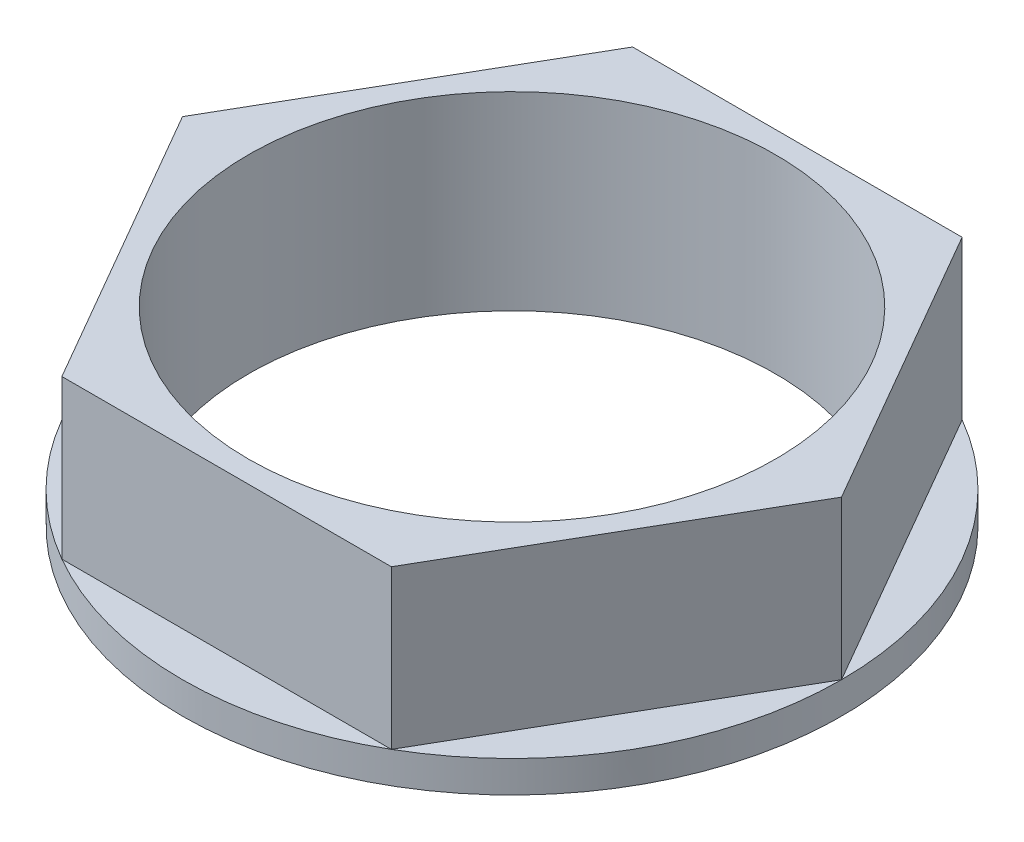
ISO-10303-21;
HEADER;
FILE_DESCRIPTION(('STEP AP214'),'2;1');
FILE_NAME('part.step','',(''),(''),'','','');
FILE_SCHEMA(('AUTOMOTIVE_DESIGN { 1 0 10303 214 1 1 1 1 }'));
ENDSEC;
DATA;
#1=APPLICATION_CONTEXT('core data for automotive mechanical design processes');
#2=APPLICATION_PROTOCOL_DEFINITION('international standard','automotive_design',2000,#1);
#3=PRODUCT_CONTEXT('',#1,'mechanical');
#4=PRODUCT('Part','Part','',(#3));
#5=PRODUCT_RELATED_PRODUCT_CATEGORY('part','',(#4));
#6=PRODUCT_DEFINITION_FORMATION('','',#4);
#7=PRODUCT_DEFINITION_CONTEXT('part definition',#1,'design');
#8=PRODUCT_DEFINITION('design','',#6,#7);
#9=PRODUCT_DEFINITION_SHAPE('','',#8);
#10=(LENGTH_UNIT() NAMED_UNIT(*) SI_UNIT(.MILLI.,.METRE.));
#11=(NAMED_UNIT(*) PLANE_ANGLE_UNIT() SI_UNIT($,.RADIAN.));
#12=(NAMED_UNIT(*) SI_UNIT($,.STERADIAN.) SOLID_ANGLE_UNIT());
#13=UNCERTAINTY_MEASURE_WITH_UNIT(LENGTH_MEASURE(1.E-05),#10,'distance_accuracy_value','');
#14=(GEOMETRIC_REPRESENTATION_CONTEXT(3) GLOBAL_UNCERTAINTY_ASSIGNED_CONTEXT((#13)) GLOBAL_UNIT_ASSIGNED_CONTEXT((#10,
#11,#12)) REPRESENTATION_CONTEXT('',''));
#15=CARTESIAN_POINT('',(0.,0.,0.));
#16=DIRECTION('',(0.,0.,1.));
#17=DIRECTION('',(1.,0.,0.));
#18=AXIS2_PLACEMENT_3D('',#15,#16,#17);
#19=CARTESIAN_POINT('',(0.,0.381,0.));
#20=DIRECTION('',(0.,1.,0.));
#21=DIRECTION('',(0.,0.,1.));
#22=AXIS2_PLACEMENT_3D('',#19,#20,#21);
#23=PLANE('',#22);
#24=DIRECTION('',(0.5,0.,0.866025403784439));
#25=VECTOR('',#24,1.);
#26=CARTESIAN_POINT('',(-7.9375,0.381,0.));
#27=LINE('',#26,#25);
#28=CARTESIAN_POINT('',(-7.9375,0.381,0.));
#29=VERTEX_POINT('',#28);
#30=CARTESIAN_POINT('',(-3.96875000000001,0.381,6.87407664253898));
#31=VERTEX_POINT('',#30);
#32=EDGE_CURVE('E55',#29,#31,#27,.T.);
#33=ORIENTED_EDGE('',*,*,#32,.F.);
#34=CARTESIAN_POINT('',(0.,0.381,0.));
#35=DIRECTION('',(0.,1.,0.));
#36=DIRECTION('',(0.,0.,1.));
#37=AXIS2_PLACEMENT_3D('',#34,#35,#36);
#38=CIRCLE('',#37,7.9375);
#39=EDGE_CURVE('E214',#29,#31,#38,.T.);
#40=ORIENTED_EDGE('',*,*,#39,.T.);
#41=EDGE_LOOP('',(#33,#40));
#42=FACE_BOUND('',#41,.T.);
#43=ADVANCED_FACE('F32',(#42),#23,.T.);
#44=DIRECTION('',(-0.5,0.,0.866025403784439));
#45=VECTOR('',#44,1.);
#46=CARTESIAN_POINT('',(-3.96875,0.381,-6.87407664253898));
#47=LINE('',#46,#45);
#48=CARTESIAN_POINT('',(-3.96875,0.381,-6.87407664253898));
#49=VERTEX_POINT('',#48);
#50=EDGE_CURVE('E108',#49,#29,#47,.T.);
#51=ORIENTED_EDGE('',*,*,#50,.F.);
#52=EDGE_CURVE('E207',#49,#29,#38,.T.);
#53=ORIENTED_EDGE('',*,*,#52,.T.);
#54=EDGE_LOOP('',(#51,#53));
#55=FACE_BOUND('',#54,.T.);
#56=ADVANCED_FACE('F171',(#55),#23,.T.);
#57=DIRECTION('',(-1.,0.,0.));
#58=VECTOR('',#57,1.);
#59=CARTESIAN_POINT('',(3.96875,0.381,-6.87407664253898));
#60=LINE('',#59,#58);
#61=CARTESIAN_POINT('',(3.96874999999999,0.381,-6.87407664253899));
#62=VERTEX_POINT('',#61);
#63=EDGE_CURVE('E128',#62,#49,#60,.T.);
#64=ORIENTED_EDGE('',*,*,#63,.F.);
#65=EDGE_CURVE('E212',#62,#49,#38,.T.);
#66=ORIENTED_EDGE('',*,*,#65,.T.);
#67=EDGE_LOOP('',(#64,#66));
#68=FACE_BOUND('',#67,.T.);
#69=ADVANCED_FACE('F177',(#68),#23,.T.);
#70=DIRECTION('',(-0.5,0.,-0.866025403784439));
#71=VECTOR('',#70,1.);
#72=CARTESIAN_POINT('',(7.93749999999999,0.381,0.));
#73=LINE('',#72,#71);
#74=CARTESIAN_POINT('',(7.9375,0.381,0.));
#75=VERTEX_POINT('',#74);
#76=EDGE_CURVE('E131',#75,#62,#73,.T.);
#77=ORIENTED_EDGE('',*,*,#76,.F.);
#78=EDGE_CURVE('E41',#75,#62,#38,.T.);
#79=ORIENTED_EDGE('',*,*,#78,.T.);
#80=EDGE_LOOP('',(#77,#79));
#81=FACE_BOUND('',#80,.T.);
#82=ADVANCED_FACE('F188',(#81),#23,.T.);
#83=DIRECTION('',(0.5,0.,-0.866025403784439));
#84=VECTOR('',#83,1.);
#85=CARTESIAN_POINT('',(3.96874999999999,0.381,6.87407664253898));
#86=LINE('',#85,#84);
#87=CARTESIAN_POINT('',(3.96874999999999,0.381,6.87407664253898));
#88=VERTEX_POINT('',#87);
#89=EDGE_CURVE('E134',#88,#75,#86,.T.);
#90=ORIENTED_EDGE('',*,*,#89,.F.);
#91=EDGE_CURVE('E11',#88,#75,#38,.T.);
#92=ORIENTED_EDGE('',*,*,#91,.T.);
#93=EDGE_LOOP('',(#90,#92));
#94=FACE_BOUND('',#93,.T.);
#95=ADVANCED_FACE('F181',(#94),#23,.T.);
#96=CARTESIAN_POINT('',(0.,0.381,0.));
#97=DIRECTION('',(0.,-1.,0.));
#98=DIRECTION('',(0.,0.,-1.));
#99=AXIS2_PLACEMENT_3D('',#96,#97,#98);
#100=CYLINDRICAL_SURFACE('',#99,7.9375);
#101=ORIENTED_EDGE('',*,*,#91,.F.);
#102=EDGE_CURVE('E42',#31,#88,#38,.T.);
#103=ORIENTED_EDGE('',*,*,#102,.F.);
#104=ORIENTED_EDGE('',*,*,#39,.F.);
#105=ORIENTED_EDGE('',*,*,#52,.F.);
#106=ORIENTED_EDGE('',*,*,#65,.F.);
#107=ORIENTED_EDGE('',*,*,#78,.F.);
#108=EDGE_LOOP('',(#101,#103,#104,#105,#106,#107));
#109=FACE_BOUND('',#108,.T.);
#110=CARTESIAN_POINT('',(0.,-0.381,0.));
#111=DIRECTION('',(0.,1.,0.));
#112=DIRECTION('',(0.,0.,1.));
#113=AXIS2_PLACEMENT_3D('',#110,#111,#112);
#114=CIRCLE('',#113,7.9375);
#115=CARTESIAN_POINT('',(0.,-0.381,7.9375));
#116=VERTEX_POINT('',#115);
#117=EDGE_CURVE('E36',#116,#116,#114,.T.);
#118=ORIENTED_EDGE('',*,*,#117,.T.);
#119=EDGE_LOOP('',(#118));
#120=FACE_BOUND('',#119,.T.);
#121=ADVANCED_FACE('F34',(#109,#120),#100,.T.);
#122=DIRECTION('',(1.,0.,0.));
#123=VECTOR('',#122,1.);
#124=CARTESIAN_POINT('',(-3.96875,0.381,6.87407664253898));
#125=LINE('',#124,#123);
#126=EDGE_CURVE('E48',#31,#88,#125,.T.);
#127=ORIENTED_EDGE('',*,*,#126,.F.);
#128=ORIENTED_EDGE('',*,*,#102,.T.);
#129=EDGE_LOOP('',(#127,#128));
#130=FACE_BOUND('',#129,.T.);
#131=ADVANCED_FACE('F173',(#130),#23,.T.);
#132=CARTESIAN_POINT('',(0.,-0.381,0.));
#133=DIRECTION('',(0.,1.,0.));
#134=DIRECTION('',(0.,0.,1.));
#135=AXIS2_PLACEMENT_3D('',#132,#133,#134);
#136=PLANE('',#135);
#137=CARTESIAN_POINT('',(0.,-0.381,0.));
#138=DIRECTION('',(0.,1.,0.));
#139=DIRECTION('',(0.,0.,1.));
#140=AXIS2_PLACEMENT_3D('',#137,#138,#139);
#141=CIRCLE('',#140,6.35);
#142=CARTESIAN_POINT('',(0.,-0.381,6.35));
#143=VERTEX_POINT('',#142);
#144=EDGE_CURVE('E139',#143,#143,#141,.T.);
#145=ORIENTED_EDGE('',*,*,#144,.T.);
#146=EDGE_LOOP('',(#145));
#147=FACE_BOUND('',#146,.T.);
#148=ORIENTED_EDGE('',*,*,#117,.F.);
#149=EDGE_LOOP('',(#148));
#150=FACE_BOUND('',#149,.T.);
#151=ADVANCED_FACE('F152',(#147,#150),#136,.F.);
#152=CARTESIAN_POINT('',(-7.9375,4.191,0.));
#153=DIRECTION('',(0.866025403784439,0.,-0.5));
#154=DIRECTION('',(-0.5,0.,-0.866025403784439));
#155=AXIS2_PLACEMENT_3D('',#152,#153,#154);
#156=PLANE('',#155);
#157=ORIENTED_EDGE('',*,*,#32,.T.);
#158=DIRECTION('',(0.,-1.,0.));
#159=VECTOR('',#158,1.);
#160=CARTESIAN_POINT('',(-3.96875,4.191,6.87407664253898));
#161=LINE('',#160,#159);
#162=CARTESIAN_POINT('',(-3.96875,4.191,6.87407664253898));
#163=VERTEX_POINT('',#162);
#164=EDGE_CURVE('E93',#163,#31,#161,.T.);
#165=ORIENTED_EDGE('',*,*,#164,.F.);
#166=DIRECTION('',(0.5,0.,0.866025403784439));
#167=VECTOR('',#166,1.);
#168=CARTESIAN_POINT('',(-7.9375,4.191,0.));
#169=LINE('',#168,#167);
#170=CARTESIAN_POINT('',(-7.9375,4.191,0.));
#171=VERTEX_POINT('',#170);
#172=EDGE_CURVE('E99',#171,#163,#169,.T.);
#173=ORIENTED_EDGE('',*,*,#172,.F.);
#174=DIRECTION('',(0.,-1.,0.));
#175=VECTOR('',#174,1.);
#176=CARTESIAN_POINT('',(-7.9375,4.191,0.));
#177=LINE('',#176,#175);
#178=EDGE_CURVE('E124',#171,#29,#177,.T.);
#179=ORIENTED_EDGE('',*,*,#178,.T.);
#180=EDGE_LOOP('',(#157,#165,#173,#179));
#181=FACE_BOUND('',#180,.T.);
#182=ADVANCED_FACE('F110',(#181),#156,.F.);
#183=CARTESIAN_POINT('',(-3.96875,4.191,6.87407664253898));
#184=DIRECTION('',(0.,0.,-1.));
#185=DIRECTION('',(-1.,0.,0.));
#186=AXIS2_PLACEMENT_3D('',#183,#184,#185);
#187=PLANE('',#186);
#188=ORIENTED_EDGE('',*,*,#126,.T.);
#189=DIRECTION('',(0.,-1.,0.));
#190=VECTOR('',#189,1.);
#191=CARTESIAN_POINT('',(3.96874999999999,4.191,6.87407664253898));
#192=LINE('',#191,#190);
#193=CARTESIAN_POINT('',(3.96874999999999,4.191,6.87407664253898));
#194=VERTEX_POINT('',#193);
#195=EDGE_CURVE('E95',#194,#88,#192,.T.);
#196=ORIENTED_EDGE('',*,*,#195,.F.);
#197=DIRECTION('',(1.,0.,0.));
#198=VECTOR('',#197,1.);
#199=CARTESIAN_POINT('',(-3.96875,4.191,6.87407664253898));
#200=LINE('',#199,#198);
#201=EDGE_CURVE('E89',#163,#194,#200,.T.);
#202=ORIENTED_EDGE('',*,*,#201,.F.);
#203=ORIENTED_EDGE('',*,*,#164,.T.);
#204=EDGE_LOOP('',(#188,#196,#202,#203));
#205=FACE_BOUND('',#204,.T.);
#206=ADVANCED_FACE('F91',(#205),#187,.F.);
#207=CARTESIAN_POINT('',(3.96874999999999,4.191,6.87407664253898));
#208=DIRECTION('',(-0.866025403784439,0.,-0.5));
#209=DIRECTION('',(-0.5,0.,0.866025403784439));
#210=AXIS2_PLACEMENT_3D('',#207,#208,#209);
#211=PLANE('',#210);
#212=ORIENTED_EDGE('',*,*,#89,.T.);
#213=DIRECTION('',(0.,-1.,0.));
#214=VECTOR('',#213,1.);
#215=CARTESIAN_POINT('',(7.93749999999999,4.191,0.));
#216=LINE('',#215,#214);
#217=CARTESIAN_POINT('',(7.93749999999999,4.191,0.));
#218=VERTEX_POINT('',#217);
#219=EDGE_CURVE('E113',#218,#75,#216,.T.);
#220=ORIENTED_EDGE('',*,*,#219,.F.);
#221=DIRECTION('',(0.5,0.,-0.866025403784439));
#222=VECTOR('',#221,1.);
#223=CARTESIAN_POINT('',(3.96874999999999,4.191,6.87407664253898));
#224=LINE('',#223,#222);
#225=EDGE_CURVE('E98',#194,#218,#224,.T.);
#226=ORIENTED_EDGE('',*,*,#225,.F.);
#227=ORIENTED_EDGE('',*,*,#195,.T.);
#228=EDGE_LOOP('',(#212,#220,#226,#227));
#229=FACE_BOUND('',#228,.T.);
#230=ADVANCED_FACE('F197',(#229),#211,.F.);
#231=CARTESIAN_POINT('',(7.93749999999999,4.191,0.));
#232=DIRECTION('',(-0.866025403784439,0.,0.5));
#233=DIRECTION('',(0.5,0.,0.866025403784439));
#234=AXIS2_PLACEMENT_3D('',#231,#232,#233);
#235=PLANE('',#234);
#236=ORIENTED_EDGE('',*,*,#76,.T.);
#237=DIRECTION('',(0.,-1.,0.));
#238=VECTOR('',#237,1.);
#239=CARTESIAN_POINT('',(3.96875,4.191,-6.87407664253898));
#240=LINE('',#239,#238);
#241=CARTESIAN_POINT('',(3.96875,4.191,-6.87407664253898));
#242=VERTEX_POINT('',#241);
#243=EDGE_CURVE('E118',#242,#62,#240,.T.);
#244=ORIENTED_EDGE('',*,*,#243,.F.);
#245=DIRECTION('',(-0.5,0.,-0.866025403784439));
#246=VECTOR('',#245,1.);
#247=CARTESIAN_POINT('',(7.93749999999999,4.191,0.));
#248=LINE('',#247,#246);
#249=EDGE_CURVE('E143',#218,#242,#248,.T.);
#250=ORIENTED_EDGE('',*,*,#249,.F.);
#251=ORIENTED_EDGE('',*,*,#219,.T.);
#252=EDGE_LOOP('',(#236,#244,#250,#251));
#253=FACE_BOUND('',#252,.T.);
#254=ADVANCED_FACE('F203',(#253),#235,.F.);
#255=CARTESIAN_POINT('',(3.96875,4.191,-6.87407664253898));
#256=DIRECTION('',(0.,0.,1.));
#257=DIRECTION('',(1.,0.,0.));
#258=AXIS2_PLACEMENT_3D('',#255,#256,#257);
#259=PLANE('',#258);
#260=ORIENTED_EDGE('',*,*,#63,.T.);
#261=DIRECTION('',(0.,-1.,0.));
#262=VECTOR('',#261,1.);
#263=CARTESIAN_POINT('',(-3.96875,4.191,-6.87407664253898));
#264=LINE('',#263,#262);
#265=CARTESIAN_POINT('',(-3.96875,4.191,-6.87407664253898));
#266=VERTEX_POINT('',#265);
#267=EDGE_CURVE('E121',#266,#49,#264,.T.);
#268=ORIENTED_EDGE('',*,*,#267,.F.);
#269=DIRECTION('',(-1.,0.,0.));
#270=VECTOR('',#269,1.);
#271=CARTESIAN_POINT('',(3.96875,4.191,-6.87407664253898));
#272=LINE('',#271,#270);
#273=EDGE_CURVE('E141',#242,#266,#272,.T.);
#274=ORIENTED_EDGE('',*,*,#273,.F.);
#275=ORIENTED_EDGE('',*,*,#243,.T.);
#276=EDGE_LOOP('',(#260,#268,#274,#275));
#277=FACE_BOUND('',#276,.T.);
#278=ADVANCED_FACE('F167',(#277),#259,.F.);
#279=CARTESIAN_POINT('',(-3.96875,4.191,-6.87407664253898));
#280=DIRECTION('',(0.866025403784439,0.,0.5));
#281=DIRECTION('',(0.5,0.,-0.866025403784439));
#282=AXIS2_PLACEMENT_3D('',#279,#280,#281);
#283=PLANE('',#282);
#284=ORIENTED_EDGE('',*,*,#50,.T.);
#285=ORIENTED_EDGE('',*,*,#178,.F.);
#286=DIRECTION('',(-0.5,0.,0.866025403784439));
#287=VECTOR('',#286,1.);
#288=CARTESIAN_POINT('',(-3.96875,4.191,-6.87407664253898));
#289=LINE('',#288,#287);
#290=EDGE_CURVE('E104',#266,#171,#289,.T.);
#291=ORIENTED_EDGE('',*,*,#290,.F.);
#292=ORIENTED_EDGE('',*,*,#267,.T.);
#293=EDGE_LOOP('',(#284,#285,#291,#292));
#294=FACE_BOUND('',#293,.T.);
#295=ADVANCED_FACE('F162',(#294),#283,.F.);
#296=CARTESIAN_POINT('',(0.,4.191,0.));
#297=DIRECTION('',(0.,1.,0.));
#298=DIRECTION('',(0.,0.,1.));
#299=AXIS2_PLACEMENT_3D('',#296,#297,#298);
#300=PLANE('',#299);
#301=CARTESIAN_POINT('',(0.,4.191,0.));
#302=DIRECTION('',(0.,1.,0.));
#303=DIRECTION('',(0.,0.,1.));
#304=AXIS2_PLACEMENT_3D('',#301,#302,#303);
#305=CIRCLE('',#304,6.35);
#306=CARTESIAN_POINT('',(0.,4.191,6.35));
#307=VERTEX_POINT('',#306);
#308=EDGE_CURVE('E146',#307,#307,#305,.T.);
#309=ORIENTED_EDGE('',*,*,#308,.F.);
#310=EDGE_LOOP('',(#309));
#311=FACE_BOUND('',#310,.T.);
#312=ORIENTED_EDGE('',*,*,#172,.T.);
#313=ORIENTED_EDGE('',*,*,#201,.T.);
#314=ORIENTED_EDGE('',*,*,#225,.T.);
#315=ORIENTED_EDGE('',*,*,#249,.T.);
#316=ORIENTED_EDGE('',*,*,#273,.T.);
#317=ORIENTED_EDGE('',*,*,#290,.T.);
#318=EDGE_LOOP('',(#312,#313,#314,#315,#316,#317));
#319=FACE_BOUND('',#318,.T.);
#320=ADVANCED_FACE('F102',(#311,#319),#300,.T.);
#321=CARTESIAN_POINT('',(0.,-0.381,0.));
#322=DIRECTION('',(0.,1.,0.));
#323=DIRECTION('',(0.,0.,1.));
#324=AXIS2_PLACEMENT_3D('',#321,#322,#323);
#325=CYLINDRICAL_SURFACE('',#324,6.35);
#326=ORIENTED_EDGE('',*,*,#144,.F.);
#327=EDGE_LOOP('',(#326));
#328=FACE_BOUND('',#327,.T.);
#329=ORIENTED_EDGE('',*,*,#308,.T.);
#330=EDGE_LOOP('',(#329));
#331=FACE_BOUND('',#330,.T.);
#332=ADVANCED_FACE('F155',(#328,#331),#325,.F.);
#333=CLOSED_SHELL('',(#43,#56,#69,#82,#95,#121,#131,#151,#182,#206,#230,#254,#278,#295,#320,#332));
#334=MANIFOLD_SOLID_BREP('B2',#333);
#335=ADVANCED_BREP_SHAPE_REPRESENTATION('',(#18,#334),#14);
#336=SHAPE_DEFINITION_REPRESENTATION(#9,#335);
ENDSEC;
END-ISO-10303-21;
